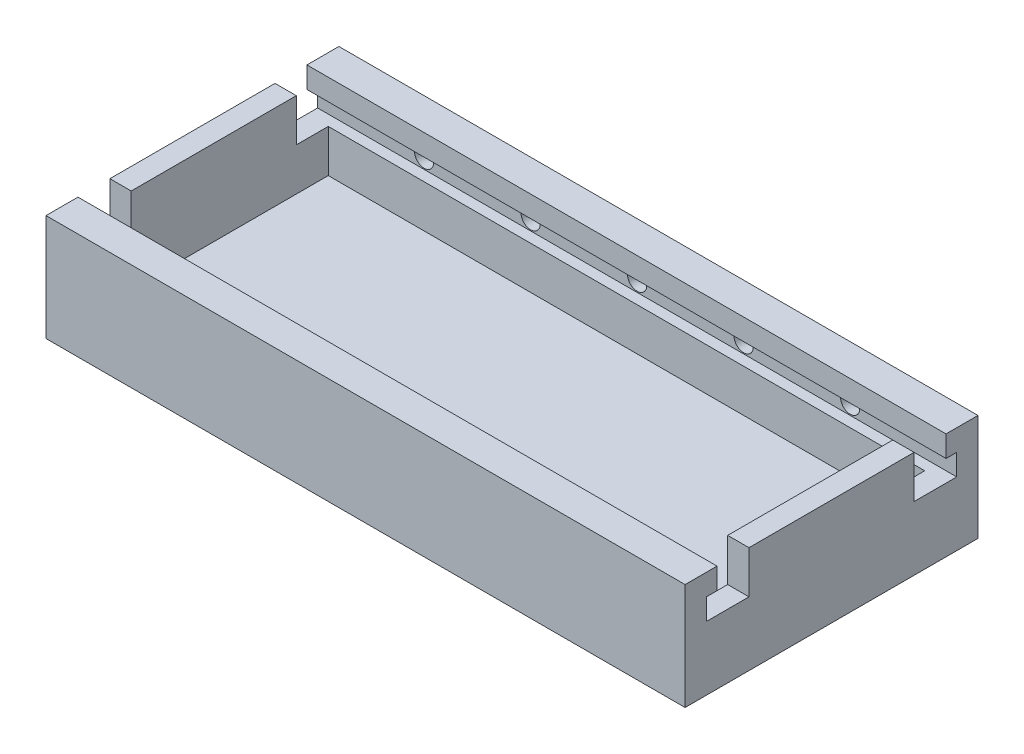
ISO-10303-21;
HEADER;
FILE_DESCRIPTION(('STEP AP214'),'2;1');
FILE_NAME('part.step','',(''),(''),'','','');
FILE_SCHEMA(('AUTOMOTIVE_DESIGN { 1 0 10303 214 1 1 1 1 }'));
ENDSEC;
DATA;
#1=APPLICATION_CONTEXT('core data for automotive mechanical design processes');
#2=APPLICATION_PROTOCOL_DEFINITION('international standard','automotive_design',2000,#1);
#3=PRODUCT_CONTEXT('',#1,'mechanical');
#4=PRODUCT('Part','Part','',(#3));
#5=PRODUCT_RELATED_PRODUCT_CATEGORY('part','',(#4));
#6=PRODUCT_DEFINITION_FORMATION('','',#4);
#7=PRODUCT_DEFINITION_CONTEXT('part definition',#1,'design');
#8=PRODUCT_DEFINITION('design','',#6,#7);
#9=PRODUCT_DEFINITION_SHAPE('','',#8);
#10=(LENGTH_UNIT() NAMED_UNIT(*) SI_UNIT(.MILLI.,.METRE.));
#11=(NAMED_UNIT(*) PLANE_ANGLE_UNIT() SI_UNIT($,.RADIAN.));
#12=(NAMED_UNIT(*) SI_UNIT($,.STERADIAN.) SOLID_ANGLE_UNIT());
#13=UNCERTAINTY_MEASURE_WITH_UNIT(LENGTH_MEASURE(1.E-05),#10,'distance_accuracy_value','');
#14=(GEOMETRIC_REPRESENTATION_CONTEXT(3) GLOBAL_UNCERTAINTY_ASSIGNED_CONTEXT((#13)) GLOBAL_UNIT_ASSIGNED_CONTEXT((#10,
#11,#12)) REPRESENTATION_CONTEXT('',''));
#15=CARTESIAN_POINT('',(0.,0.,0.));
#16=DIRECTION('',(0.,0.,1.));
#17=DIRECTION('',(1.,0.,0.));
#18=AXIS2_PLACEMENT_3D('',#15,#16,#17);
#19=CARTESIAN_POINT('',(48.4572815533981,7.62,-7.60150485436893));
#20=DIRECTION('',(0.,1.,0.));
#21=DIRECTION('',(0.,0.,1.));
#22=AXIS2_PLACEMENT_3D('',#19,#20,#21);
#23=PLANE('',#22);
#24=DIRECTION('',(0.,0.,1.));
#25=VECTOR('',#24,1.);
#26=CARTESIAN_POINT('',(48.4572815533981,7.62,-7.60150485436893));
#27=LINE('',#26,#25);
#28=CARTESIAN_POINT('',(48.4572815533981,7.62,17.1634951456311));
#29=VERTEX_POINT('',#28);
#30=CARTESIAN_POINT('',(48.4572815533981,7.62,22.2434951456311));
#31=VERTEX_POINT('',#30);
#32=EDGE_CURVE('E354',#29,#31,#27,.T.);
#33=ORIENTED_EDGE('',*,*,#32,.F.);
#34=DIRECTION('',(1.,0.,0.));
#35=VECTOR('',#34,1.);
#36=CARTESIAN_POINT('',(45.9172815533981,7.62,17.1634951456311));
#37=LINE('',#36,#35);
#38=CARTESIAN_POINT('',(45.9172815533981,7.62,17.1634951456311));
#39=VERTEX_POINT('',#38);
#40=EDGE_CURVE('E540',#39,#29,#37,.T.);
#41=ORIENTED_EDGE('',*,*,#40,.F.);
#42=DIRECTION('',(0.,0.,-1.));
#43=VECTOR('',#42,1.);
#44=CARTESIAN_POINT('',(45.9172815533981,7.62,-10.1415048543689));
#45=LINE('',#44,#43);
#46=CARTESIAN_POINT('',(45.9172815533981,7.62,20.9734951456311));
#47=VERTEX_POINT('',#46);
#48=EDGE_CURVE('E226',#47,#39,#45,.T.);
#49=ORIENTED_EDGE('',*,*,#48,.F.);
#50=DIRECTION('',(1.,0.,0.));
#51=VECTOR('',#50,1.);
#52=CARTESIAN_POINT('',(-27.7427184466019,7.62,20.9734951456311));
#53=LINE('',#52,#51);
#54=CARTESIAN_POINT('',(-25.2027184466019,7.62,20.9734951456311));
#55=VERTEX_POINT('',#54);
#56=EDGE_CURVE('E362',#55,#47,#53,.T.);
#57=ORIENTED_EDGE('',*,*,#56,.F.);
#58=DIRECTION('',(0.,0.,1.));
#59=VECTOR('',#58,1.);
#60=CARTESIAN_POINT('',(-25.202718446602,7.62,-10.1415048543689));
#61=LINE('',#60,#59);
#62=CARTESIAN_POINT('',(-25.2027184466019,7.62,17.1634951456311));
#63=VERTEX_POINT('',#62);
#64=EDGE_CURVE('E365',#63,#55,#61,.T.);
#65=ORIENTED_EDGE('',*,*,#64,.F.);
#66=DIRECTION('',(1.,0.,0.));
#67=VECTOR('',#66,1.);
#68=CARTESIAN_POINT('',(-27.7427184466019,7.62,17.1634951456311));
#69=LINE('',#68,#67);
#70=CARTESIAN_POINT('',(-27.7427184466019,7.62,17.1634951456311));
#71=VERTEX_POINT('',#70);
#72=EDGE_CURVE('E227',#71,#63,#69,.T.);
#73=ORIENTED_EDGE('',*,*,#72,.F.);
#74=DIRECTION('',(0.,0.,1.));
#75=VECTOR('',#74,1.);
#76=CARTESIAN_POINT('',(-27.7427184466019,7.62,-7.60150485436893));
#77=LINE('',#76,#75);
#78=CARTESIAN_POINT('',(-27.7427184466019,7.62,22.2434951456311));
#79=VERTEX_POINT('',#78);
#80=EDGE_CURVE('E350',#71,#79,#77,.T.);
#81=ORIENTED_EDGE('',*,*,#80,.T.);
#82=DIRECTION('',(-1.,0.,0.));
#83=VECTOR('',#82,1.);
#84=CARTESIAN_POINT('',(48.4572815533981,7.62,22.2434951456311));
#85=LINE('',#84,#83);
#86=EDGE_CURVE('E323',#31,#79,#85,.T.);
#87=ORIENTED_EDGE('',*,*,#86,.F.);
#88=EDGE_LOOP('',(#33,#41,#49,#57,#65,#73,#81,#87));
#89=FACE_BOUND('',#88,.T.);
#90=ADVANCED_FACE('F41',(#89),#23,.T.);
#91=CARTESIAN_POINT('',(45.9172815533981,7.62,-2.52150485436887));
#92=VERTEX_POINT('',#91);
#93=CARTESIAN_POINT('',(45.9172815533981,7.62,-6.33150485436893));
#94=VERTEX_POINT('',#93);
#95=EDGE_CURVE('E360',#92,#94,#45,.T.);
#96=ORIENTED_EDGE('',*,*,#95,.F.);
#97=DIRECTION('',(-1.,0.,0.));
#98=VECTOR('',#97,1.);
#99=CARTESIAN_POINT('',(45.9172815533981,7.62,-2.52150485436887));
#100=LINE('',#99,#98);
#101=CARTESIAN_POINT('',(48.4572815533981,7.62,-2.52150485436887));
#102=VERTEX_POINT('',#101);
#103=EDGE_CURVE('E221',#102,#92,#100,.T.);
#104=ORIENTED_EDGE('',*,*,#103,.F.);
#105=CARTESIAN_POINT('',(48.4572815533981,7.62,-7.60150485436893));
#106=VERTEX_POINT('',#105);
#107=EDGE_CURVE('E355',#106,#102,#27,.T.);
#108=ORIENTED_EDGE('',*,*,#107,.F.);
#109=DIRECTION('',(-1.,0.,0.));
#110=VECTOR('',#109,1.);
#111=CARTESIAN_POINT('',(48.4572815533981,7.62,-7.60150485436893));
#112=LINE('',#111,#110);
#113=CARTESIAN_POINT('',(-27.7427184466019,7.62,-7.60150485436893));
#114=VERTEX_POINT('',#113);
#115=EDGE_CURVE('E335',#106,#114,#112,.T.);
#116=ORIENTED_EDGE('',*,*,#115,.T.);
#117=CARTESIAN_POINT('',(-27.7427184466019,7.62,-2.52150485436887));
#118=VERTEX_POINT('',#117);
#119=EDGE_CURVE('E351',#114,#118,#77,.T.);
#120=ORIENTED_EDGE('',*,*,#119,.T.);
#121=DIRECTION('',(-1.,0.,0.));
#122=VECTOR('',#121,1.);
#123=CARTESIAN_POINT('',(-27.7427184466019,7.62,-2.52150485436887));
#124=LINE('',#123,#122);
#125=CARTESIAN_POINT('',(-25.2027184466019,7.62,-2.52150485436887));
#126=VERTEX_POINT('',#125);
#127=EDGE_CURVE('E229',#126,#118,#124,.T.);
#128=ORIENTED_EDGE('',*,*,#127,.F.);
#129=CARTESIAN_POINT('',(-25.202718446602,7.62,-6.33150485436893));
#130=VERTEX_POINT('',#129);
#131=EDGE_CURVE('E366',#130,#126,#61,.T.);
#132=ORIENTED_EDGE('',*,*,#131,.F.);
#133=DIRECTION('',(-1.,0.,0.));
#134=VECTOR('',#133,1.);
#135=CARTESIAN_POINT('',(-27.742718446602,7.62,-6.33150485436893));
#136=LINE('',#135,#134);
#137=EDGE_CURVE('E12',#94,#130,#136,.T.);
#138=ORIENTED_EDGE('',*,*,#137,.F.);
#139=EDGE_LOOP('',(#96,#104,#108,#116,#120,#128,#132,#138));
#140=FACE_BOUND('',#139,.T.);
#141=ADVANCED_FACE('F451',(#140),#23,.T.);
#142=CARTESIAN_POINT('',(0.,12.7,0.));
#143=DIRECTION('',(0.,1.,0.));
#144=DIRECTION('',(0.,0.,1.));
#145=AXIS2_PLACEMENT_3D('',#142,#143,#144);
#146=PLANE('',#145);
#147=DIRECTION('',(-1.,0.,0.));
#148=VECTOR('',#147,1.);
#149=CARTESIAN_POINT('',(-27.742718446602,12.7,-6.33150485436893));
#150=LINE('',#149,#148);
#151=CARTESIAN_POINT('',(48.4572815533981,12.7,-6.33150485436893));
#152=VERTEX_POINT('',#151);
#153=CARTESIAN_POINT('',(-27.742718446602,12.7,-6.33150485436893));
#154=VERTEX_POINT('',#153);
#155=EDGE_CURVE('E380',#152,#154,#150,.T.);
#156=ORIENTED_EDGE('',*,*,#155,.F.);
#157=DIRECTION('',(0.,0.,-1.));
#158=VECTOR('',#157,1.);
#159=CARTESIAN_POINT('',(48.4572815533981,12.7,-10.1415048543689));
#160=LINE('',#159,#158);
#161=CARTESIAN_POINT('',(48.4572815533981,12.7,-10.1415048543689));
#162=VERTEX_POINT('',#161);
#163=EDGE_CURVE('E400',#152,#162,#160,.T.);
#164=ORIENTED_EDGE('',*,*,#163,.T.);
#165=DIRECTION('',(-1.,0.,0.));
#166=VECTOR('',#165,1.);
#167=CARTESIAN_POINT('',(-27.742718446602,12.7,-10.1415048543689));
#168=LINE('',#167,#166);
#169=CARTESIAN_POINT('',(-27.742718446602,12.7,-10.1415048543689));
#170=VERTEX_POINT('',#169);
#171=EDGE_CURVE('E404',#162,#170,#168,.T.);
#172=ORIENTED_EDGE('',*,*,#171,.T.);
#173=DIRECTION('',(0.,0.,1.));
#174=VECTOR('',#173,1.);
#175=CARTESIAN_POINT('',(-27.742718446602,12.7,-10.1415048543689));
#176=LINE('',#175,#174);
#177=EDGE_CURVE('E394',#170,#154,#176,.T.);
#178=ORIENTED_EDGE('',*,*,#177,.T.);
#179=EDGE_LOOP('',(#156,#164,#172,#178));
#180=FACE_BOUND('',#179,.T.);
#181=ADVANCED_FACE('F458',(#180),#146,.T.);
#182=CARTESIAN_POINT('',(48.4572815533981,10.16,-7.60150485436893));
#183=DIRECTION('',(0.,-1.,0.));
#184=DIRECTION('',(0.,0.,-1.));
#185=AXIS2_PLACEMENT_3D('',#182,#183,#184);
#186=PLANE('',#185);
#187=DIRECTION('',(0.,0.,1.));
#188=VECTOR('',#187,1.);
#189=CARTESIAN_POINT('',(48.4572815533981,10.16,-7.60150485436893));
#190=LINE('',#189,#188);
#191=CARTESIAN_POINT('',(48.4572815533981,10.16,-7.60150485436893));
#192=VERTEX_POINT('',#191);
#193=CARTESIAN_POINT('',(48.4572815533981,10.16,-6.33150485436893));
#194=VERTEX_POINT('',#193);
#195=EDGE_CURVE('E343',#192,#194,#190,.T.);
#196=ORIENTED_EDGE('',*,*,#195,.T.);
#197=DIRECTION('',(1.,0.,0.));
#198=VECTOR('',#197,1.);
#199=CARTESIAN_POINT('',(-27.742718446602,10.16,-6.33150485436893));
#200=LINE('',#199,#198);
#201=CARTESIAN_POINT('',(-27.7427184466019,10.16,-6.33150485436893));
#202=VERTEX_POINT('',#201);
#203=EDGE_CURVE('E50',#202,#194,#200,.T.);
#204=ORIENTED_EDGE('',*,*,#203,.F.);
#205=DIRECTION('',(0.,0.,1.));
#206=VECTOR('',#205,1.);
#207=CARTESIAN_POINT('',(-27.7427184466019,10.16,-7.60150485436893));
#208=LINE('',#207,#206);
#209=CARTESIAN_POINT('',(-27.7427184466019,10.16,-7.60150485436893));
#210=VERTEX_POINT('',#209);
#211=EDGE_CURVE('E347',#210,#202,#208,.T.);
#212=ORIENTED_EDGE('',*,*,#211,.F.);
#213=DIRECTION('',(1.,0.,0.));
#214=VECTOR('',#213,1.);
#215=CARTESIAN_POINT('',(48.4572815533981,10.16,-7.60150485436893));
#216=LINE('',#215,#214);
#217=EDGE_CURVE('E340',#210,#192,#216,.T.);
#218=ORIENTED_EDGE('',*,*,#217,.T.);
#219=EDGE_LOOP('',(#196,#204,#212,#218));
#220=FACE_BOUND('',#219,.T.);
#221=ADVANCED_FACE('F528',(#220),#186,.T.);
#222=CARTESIAN_POINT('',(-27.7427184466019,12.7,20.9734951456311));
#223=DIRECTION('',(0.,0.,-1.));
#224=DIRECTION('',(-1.,0.,0.));
#225=AXIS2_PLACEMENT_3D('',#222,#223,#224);
#226=PLANE('',#225);
#227=DIRECTION('',(1.,0.,0.));
#228=VECTOR('',#227,1.);
#229=CARTESIAN_POINT('',(-27.7427184466019,12.7,20.9734951456311));
#230=LINE('',#229,#228);
#231=CARTESIAN_POINT('',(-27.742718446602,12.7,20.9734951456311));
#232=VERTEX_POINT('',#231);
#233=CARTESIAN_POINT('',(48.4572815533981,12.7,20.9734951456311));
#234=VERTEX_POINT('',#233);
#235=EDGE_CURVE('E391',#232,#234,#230,.T.);
#236=ORIENTED_EDGE('',*,*,#235,.T.);
#237=DIRECTION('',(0.,1.,0.));
#238=VECTOR('',#237,1.);
#239=CARTESIAN_POINT('',(48.4572815533981,10.16,20.9734951456311));
#240=LINE('',#239,#238);
#241=CARTESIAN_POINT('',(48.4572815533981,10.16,20.9734951456311));
#242=VERTEX_POINT('',#241);
#243=EDGE_CURVE('E308',#242,#234,#240,.T.);
#244=ORIENTED_EDGE('',*,*,#243,.F.);
#245=DIRECTION('',(-1.,0.,0.));
#246=VECTOR('',#245,1.);
#247=CARTESIAN_POINT('',(-27.7427184466019,10.16,20.9734951456311));
#248=LINE('',#247,#246);
#249=CARTESIAN_POINT('',(-27.742718446602,10.16,20.9734951456311));
#250=VERTEX_POINT('',#249);
#251=EDGE_CURVE('E358',#242,#250,#248,.T.);
#252=ORIENTED_EDGE('',*,*,#251,.T.);
#253=DIRECTION('',(0.,1.,0.));
#254=VECTOR('',#253,1.);
#255=CARTESIAN_POINT('',(-27.742718446602,10.16,20.9734951456311));
#256=LINE('',#255,#254);
#257=EDGE_CURVE('E315',#250,#232,#256,.T.);
#258=ORIENTED_EDGE('',*,*,#257,.T.);
#259=EDGE_LOOP('',(#236,#244,#252,#258));
#260=FACE_BOUND('',#259,.T.);
#261=ADVANCED_FACE('F473',(#260),#226,.T.);
#262=CARTESIAN_POINT('',(-27.742718446602,12.7,-6.33150485436893));
#263=DIRECTION('',(0.,0.,1.));
#264=DIRECTION('',(1.,0.,0.));
#265=AXIS2_PLACEMENT_3D('',#262,#263,#264);
#266=PLANE('',#265);
#267=ORIENTED_EDGE('',*,*,#155,.T.);
#268=DIRECTION('',(0.,1.,0.));
#269=VECTOR('',#268,1.);
#270=CARTESIAN_POINT('',(-27.742718446602,10.16,-6.33150485436893));
#271=LINE('',#270,#269);
#272=EDGE_CURVE('E312',#202,#154,#271,.T.);
#273=ORIENTED_EDGE('',*,*,#272,.F.);
#274=ORIENTED_EDGE('',*,*,#203,.T.);
#275=DIRECTION('',(0.,1.,0.));
#276=VECTOR('',#275,1.);
#277=CARTESIAN_POINT('',(48.4572815533981,10.16,-6.33150485436893));
#278=LINE('',#277,#276);
#279=EDGE_CURVE('E309',#194,#152,#278,.T.);
#280=ORIENTED_EDGE('',*,*,#279,.T.);
#281=EDGE_LOOP('',(#267,#273,#274,#280));
#282=FACE_BOUND('',#281,.T.);
#283=ADVANCED_FACE('F481',(#282),#266,.T.);
#284=CARTESIAN_POINT('',(-27.742718446602,12.7,-10.1415048543689));
#285=DIRECTION('',(1.,0.,0.));
#286=DIRECTION('',(0.,0.,-1.));
#287=AXIS2_PLACEMENT_3D('',#284,#285,#286);
#288=PLANE('',#287);
#289=CARTESIAN_POINT('',(-27.7427184466019,12.7,24.7834951456311));
#290=VERTEX_POINT('',#289);
#291=EDGE_CURVE('E398',#232,#290,#176,.T.);
#292=ORIENTED_EDGE('',*,*,#291,.F.);
#293=ORIENTED_EDGE('',*,*,#257,.F.);
#294=CARTESIAN_POINT('',(-27.7427184466019,10.16,22.2434951456311));
#295=VERTEX_POINT('',#294);
#296=EDGE_CURVE('E346',#250,#295,#208,.T.);
#297=ORIENTED_EDGE('',*,*,#296,.T.);
#298=DIRECTION('',(0.,1.,0.));
#299=VECTOR('',#298,1.);
#300=CARTESIAN_POINT('',(-27.7427184466019,10.16,22.2434951456311));
#301=LINE('',#300,#299);
#302=EDGE_CURVE('E326',#79,#295,#301,.T.);
#303=ORIENTED_EDGE('',*,*,#302,.F.);
#304=ORIENTED_EDGE('',*,*,#80,.F.);
#305=DIRECTION('',(0.,-1.,0.));
#306=VECTOR('',#305,1.);
#307=CARTESIAN_POINT('',(-27.7427184466019,12.7,17.1634951456311));
#308=LINE('',#307,#306);
#309=CARTESIAN_POINT('',(-27.7427184466019,12.7,17.1634951456311));
#310=VERTEX_POINT('',#309);
#311=EDGE_CURVE('E251',#310,#71,#308,.T.);
#312=ORIENTED_EDGE('',*,*,#311,.F.);
#313=DIRECTION('',(0.,0.,1.));
#314=VECTOR('',#313,1.);
#315=CARTESIAN_POINT('',(-27.7427184466019,12.7,-2.52150485436887));
#316=LINE('',#315,#314);
#317=CARTESIAN_POINT('',(-27.7427184466019,12.7,-2.52150485436887));
#318=VERTEX_POINT('',#317);
#319=EDGE_CURVE('E235',#318,#310,#316,.T.);
#320=ORIENTED_EDGE('',*,*,#319,.F.);
#321=DIRECTION('',(0.,-1.,0.));
#322=VECTOR('',#321,1.);
#323=CARTESIAN_POINT('',(-27.7427184466019,12.7,-2.52150485436887));
#324=LINE('',#323,#322);
#325=EDGE_CURVE('E243',#318,#118,#324,.T.);
#326=ORIENTED_EDGE('',*,*,#325,.T.);
#327=ORIENTED_EDGE('',*,*,#119,.F.);
#328=DIRECTION('',(0.,1.,0.));
#329=VECTOR('',#328,1.);
#330=CARTESIAN_POINT('',(-27.7427184466019,10.16,-7.60150485436893));
#331=LINE('',#330,#329);
#332=EDGE_CURVE('E337',#114,#210,#331,.T.);
#333=ORIENTED_EDGE('',*,*,#332,.T.);
#334=ORIENTED_EDGE('',*,*,#211,.T.);
#335=ORIENTED_EDGE('',*,*,#272,.T.);
#336=ORIENTED_EDGE('',*,*,#177,.F.);
#337=DIRECTION('',(0.,-1.,0.));
#338=VECTOR('',#337,1.);
#339=CARTESIAN_POINT('',(-27.742718446602,12.7,-10.1415048543689));
#340=LINE('',#339,#338);
#341=CARTESIAN_POINT('',(-27.742718446602,0.,-10.1415048543689));
#342=VERTEX_POINT('',#341);
#343=EDGE_CURVE('E406',#170,#342,#340,.T.);
#344=ORIENTED_EDGE('',*,*,#343,.T.);
#345=DIRECTION('',(0.,0.,1.));
#346=VECTOR('',#345,1.);
#347=CARTESIAN_POINT('',(-27.742718446602,0.,-10.1415048543689));
#348=LINE('',#347,#346);
#349=CARTESIAN_POINT('',(-27.7427184466019,0.,24.7834951456311));
#350=VERTEX_POINT('',#349);
#351=EDGE_CURVE('E375',#342,#350,#348,.T.);
#352=ORIENTED_EDGE('',*,*,#351,.T.);
#353=DIRECTION('',(0.,-1.,0.));
#354=VECTOR('',#353,1.);
#355=CARTESIAN_POINT('',(-27.7427184466019,12.7,24.7834951456311));
#356=LINE('',#355,#354);
#357=EDGE_CURVE('E423',#290,#350,#356,.T.);
#358=ORIENTED_EDGE('',*,*,#357,.F.);
#359=EDGE_LOOP('',(#292,#293,#297,#303,#304,#312,#320,#326,#327,#333,#334,#335,#336,#344,#352,#358));
#360=FACE_BOUND('',#359,.T.);
#361=ADVANCED_FACE('F43',(#360),#288,.F.);
#362=CARTESIAN_POINT('',(-27.7427184466019,12.7,24.7834951456311));
#363=DIRECTION('',(0.,0.,-1.));
#364=DIRECTION('',(-1.,0.,0.));
#365=AXIS2_PLACEMENT_3D('',#362,#363,#364);
#366=PLANE('',#365);
#367=DIRECTION('',(1.,0.,0.));
#368=VECTOR('',#367,1.);
#369=CARTESIAN_POINT('',(-27.7427184466019,0.,24.7834951456311));
#370=LINE('',#369,#368);
#371=CARTESIAN_POINT('',(48.4572815533981,0.,24.7834951456311));
#372=VERTEX_POINT('',#371);
#373=EDGE_CURVE('E409',#350,#372,#370,.T.);
#374=ORIENTED_EDGE('',*,*,#373,.T.);
#375=DIRECTION('',(0.,-1.,0.));
#376=VECTOR('',#375,1.);
#377=CARTESIAN_POINT('',(48.4572815533981,12.7,24.7834951456311));
#378=LINE('',#377,#376);
#379=CARTESIAN_POINT('',(48.4572815533981,12.7,24.7834951456311));
#380=VERTEX_POINT('',#379);
#381=EDGE_CURVE('E420',#380,#372,#378,.T.);
#382=ORIENTED_EDGE('',*,*,#381,.F.);
#383=DIRECTION('',(1.,0.,0.));
#384=VECTOR('',#383,1.);
#385=CARTESIAN_POINT('',(-27.7427184466019,12.7,24.7834951456311));
#386=LINE('',#385,#384);
#387=EDGE_CURVE('E397',#290,#380,#386,.T.);
#388=ORIENTED_EDGE('',*,*,#387,.F.);
#389=ORIENTED_EDGE('',*,*,#357,.T.);
#390=EDGE_LOOP('',(#374,#382,#388,#389));
#391=FACE_BOUND('',#390,.T.);
#392=ADVANCED_FACE('F500',(#391),#366,.F.);
#393=CARTESIAN_POINT('',(48.4572815533981,12.7,-10.1415048543689));
#394=DIRECTION('',(-1.,0.,0.));
#395=DIRECTION('',(0.,0.,1.));
#396=AXIS2_PLACEMENT_3D('',#393,#394,#395);
#397=PLANE('',#396);
#398=ORIENTED_EDGE('',*,*,#163,.F.);
#399=ORIENTED_EDGE('',*,*,#279,.F.);
#400=ORIENTED_EDGE('',*,*,#195,.F.);
#401=DIRECTION('',(0.,-1.,0.));
#402=VECTOR('',#401,1.);
#403=CARTESIAN_POINT('',(48.4572815533981,10.16,-7.60150485436893));
#404=LINE('',#403,#402);
#405=EDGE_CURVE('E332',#192,#106,#404,.T.);
#406=ORIENTED_EDGE('',*,*,#405,.T.);
#407=ORIENTED_EDGE('',*,*,#107,.T.);
#408=DIRECTION('',(0.,-1.,0.));
#409=VECTOR('',#408,1.);
#410=CARTESIAN_POINT('',(48.4572815533981,12.7,-2.52150485436887));
#411=LINE('',#410,#409);
#412=CARTESIAN_POINT('',(48.4572815533981,12.7,-2.52150485436887));
#413=VERTEX_POINT('',#412);
#414=EDGE_CURVE('E231',#413,#102,#411,.T.);
#415=ORIENTED_EDGE('',*,*,#414,.F.);
#416=DIRECTION('',(0.,0.,-1.));
#417=VECTOR('',#416,1.);
#418=CARTESIAN_POINT('',(48.4572815533981,12.7,-2.52150485436887));
#419=LINE('',#418,#417);
#420=CARTESIAN_POINT('',(48.4572815533981,12.7,17.1634951456311));
#421=VERTEX_POINT('',#420);
#422=EDGE_CURVE('E215',#421,#413,#419,.T.);
#423=ORIENTED_EDGE('',*,*,#422,.F.);
#424=DIRECTION('',(0.,-1.,0.));
#425=VECTOR('',#424,1.);
#426=CARTESIAN_POINT('',(48.4572815533981,12.7,17.1634951456311));
#427=LINE('',#426,#425);
#428=EDGE_CURVE('E212',#421,#29,#427,.T.);
#429=ORIENTED_EDGE('',*,*,#428,.T.);
#430=ORIENTED_EDGE('',*,*,#32,.T.);
#431=DIRECTION('',(0.,-1.,0.));
#432=VECTOR('',#431,1.);
#433=CARTESIAN_POINT('',(48.4572815533981,10.16,22.2434951456311));
#434=LINE('',#433,#432);
#435=CARTESIAN_POINT('',(48.4572815533981,10.16,22.2434951456311));
#436=VERTEX_POINT('',#435);
#437=EDGE_CURVE('E318',#436,#31,#434,.T.);
#438=ORIENTED_EDGE('',*,*,#437,.F.);
#439=EDGE_CURVE('E342',#242,#436,#190,.T.);
#440=ORIENTED_EDGE('',*,*,#439,.F.);
#441=ORIENTED_EDGE('',*,*,#243,.T.);
#442=EDGE_CURVE('E401',#380,#234,#160,.T.);
#443=ORIENTED_EDGE('',*,*,#442,.F.);
#444=ORIENTED_EDGE('',*,*,#381,.T.);
#445=DIRECTION('',(0.,0.,-1.));
#446=VECTOR('',#445,1.);
#447=CARTESIAN_POINT('',(48.4572815533981,0.,-10.1415048543689));
#448=LINE('',#447,#446);
#449=CARTESIAN_POINT('',(48.4572815533981,0.,-10.1415048543689));
#450=VERTEX_POINT('',#449);
#451=EDGE_CURVE('E411',#372,#450,#448,.T.);
#452=ORIENTED_EDGE('',*,*,#451,.T.);
#453=DIRECTION('',(0.,-1.,0.));
#454=VECTOR('',#453,1.);
#455=CARTESIAN_POINT('',(48.4572815533981,12.7,-10.1415048543689));
#456=LINE('',#455,#454);
#457=EDGE_CURVE('E417',#162,#450,#456,.T.);
#458=ORIENTED_EDGE('',*,*,#457,.F.);
#459=EDGE_LOOP('',(#398,#399,#400,#406,#407,#415,#423,#429,#430,#438,#440,#441,#443,#444,#452,#458));
#460=FACE_BOUND('',#459,.T.);
#461=ADVANCED_FACE('F497',(#460),#397,.F.);
#462=CARTESIAN_POINT('',(-27.742718446602,12.7,-10.1415048543689));
#463=DIRECTION('',(0.,0.,1.));
#464=DIRECTION('',(1.,0.,0.));
#465=AXIS2_PLACEMENT_3D('',#462,#463,#464);
#466=PLANE('',#465);
#467=DIRECTION('',(-1.,0.,0.));
#468=VECTOR('',#467,1.);
#469=CARTESIAN_POINT('',(-27.742718446602,0.,-10.1415048543689));
#470=LINE('',#469,#468);
#471=EDGE_CURVE('E413',#450,#342,#470,.T.);
#472=ORIENTED_EDGE('',*,*,#471,.T.);
#473=ORIENTED_EDGE('',*,*,#343,.F.);
#474=ORIENTED_EDGE('',*,*,#171,.F.);
#475=ORIENTED_EDGE('',*,*,#457,.T.);
#476=EDGE_LOOP('',(#472,#473,#474,#475));
#477=FACE_BOUND('',#476,.T.);
#478=ADVANCED_FACE('F490',(#477),#466,.F.);
#479=ORIENTED_EDGE('',*,*,#442,.T.);
#480=ORIENTED_EDGE('',*,*,#235,.F.);
#481=ORIENTED_EDGE('',*,*,#291,.T.);
#482=ORIENTED_EDGE('',*,*,#387,.T.);
#483=EDGE_LOOP('',(#479,#480,#481,#482));
#484=FACE_BOUND('',#483,.T.);
#485=ADVANCED_FACE('F486',(#484),#146,.T.);
#486=CARTESIAN_POINT('',(0.,0.,0.));
#487=DIRECTION('',(0.,1.,0.));
#488=DIRECTION('',(0.,0.,1.));
#489=AXIS2_PLACEMENT_3D('',#486,#487,#488);
#490=PLANE('',#489);
#491=ORIENTED_EDGE('',*,*,#351,.F.);
#492=ORIENTED_EDGE('',*,*,#471,.F.);
#493=ORIENTED_EDGE('',*,*,#451,.F.);
#494=ORIENTED_EDGE('',*,*,#373,.F.);
#495=EDGE_LOOP('',(#491,#492,#493,#494));
#496=FACE_BOUND('',#495,.T.);
#497=ADVANCED_FACE('F489',(#496),#490,.F.);
#498=ORIENTED_EDGE('',*,*,#251,.F.);
#499=ORIENTED_EDGE('',*,*,#439,.T.);
#500=DIRECTION('',(1.,0.,0.));
#501=VECTOR('',#500,1.);
#502=CARTESIAN_POINT('',(48.4572815533981,10.16,22.2434951456311));
#503=LINE('',#502,#501);
#504=EDGE_CURVE('E329',#295,#436,#503,.T.);
#505=ORIENTED_EDGE('',*,*,#504,.F.);
#506=ORIENTED_EDGE('',*,*,#296,.F.);
#507=EDGE_LOOP('',(#498,#499,#505,#506));
#508=FACE_BOUND('',#507,.T.);
#509=ADVANCED_FACE('F463',(#508),#186,.T.);
#510=CARTESIAN_POINT('',(0.,0.,-7.60150485436893));
#511=DIRECTION('',(0.,0.,-1.));
#512=DIRECTION('',(-1.,0.,0.));
#513=AXIS2_PLACEMENT_3D('',#510,#511,#512);
#514=PLANE('',#513);
#515=CARTESIAN_POINT('',(-15.0427184466019,8.88999999999995,-7.60150485436893));
#516=DIRECTION('',(0.,0.,1.));
#517=DIRECTION('',(1.,0.,0.));
#518=AXIS2_PLACEMENT_3D('',#515,#516,#517);
#519=CIRCLE('',#518,1.143);
#520=CARTESIAN_POINT('',(-13.8997184466019,8.88999999999995,-7.60150485436893));
#521=VERTEX_POINT('',#520);
#522=EDGE_CURVE('E293',#521,#521,#519,.T.);
#523=ORIENTED_EDGE('',*,*,#522,.F.);
#524=EDGE_LOOP('',(#523));
#525=FACE_BOUND('',#524,.T.);
#526=CARTESIAN_POINT('',(-2.34271844660195,8.88999999999997,-7.60150485436893));
#527=DIRECTION('',(0.,0.,1.));
#528=DIRECTION('',(1.,0.,0.));
#529=AXIS2_PLACEMENT_3D('',#526,#527,#528);
#530=CIRCLE('',#529,1.143);
#531=CARTESIAN_POINT('',(-1.19971844660195,8.88999999999997,-7.60150485436893));
#532=VERTEX_POINT('',#531);
#533=EDGE_CURVE('E296',#532,#532,#530,.T.);
#534=ORIENTED_EDGE('',*,*,#533,.F.);
#535=EDGE_LOOP('',(#534));
#536=FACE_BOUND('',#535,.T.);
#537=CARTESIAN_POINT('',(35.7572815533981,8.89000000000005,-7.60150485436893));
#538=DIRECTION('',(0.,0.,1.));
#539=DIRECTION('',(1.,0.,0.));
#540=AXIS2_PLACEMENT_3D('',#537,#538,#539);
#541=CIRCLE('',#540,1.143);
#542=CARTESIAN_POINT('',(36.9002815533981,8.89000000000005,-7.60150485436893));
#543=VERTEX_POINT('',#542);
#544=EDGE_CURVE('E299',#543,#543,#541,.T.);
#545=ORIENTED_EDGE('',*,*,#544,.F.);
#546=EDGE_LOOP('',(#545));
#547=FACE_BOUND('',#546,.T.);
#548=CARTESIAN_POINT('',(23.0572815533981,8.89000000000002,-7.60150485436893));
#549=DIRECTION('',(0.,0.,1.));
#550=DIRECTION('',(1.,0.,0.));
#551=AXIS2_PLACEMENT_3D('',#548,#549,#550);
#552=CIRCLE('',#551,1.143);
#553=CARTESIAN_POINT('',(24.2002815533981,8.89000000000002,-7.60150485436893));
#554=VERTEX_POINT('',#553);
#555=EDGE_CURVE('E302',#554,#554,#552,.T.);
#556=ORIENTED_EDGE('',*,*,#555,.F.);
#557=EDGE_LOOP('',(#556));
#558=FACE_BOUND('',#557,.T.);
#559=CARTESIAN_POINT('',(10.3572815533981,8.89,-7.60150485436893));
#560=DIRECTION('',(0.,0.,1.));
#561=DIRECTION('',(1.,0.,0.));
#562=AXIS2_PLACEMENT_3D('',#559,#560,#561);
#563=CIRCLE('',#562,1.143);
#564=CARTESIAN_POINT('',(11.5002815533981,8.89,-7.60150485436893));
#565=VERTEX_POINT('',#564);
#566=EDGE_CURVE('E305',#565,#565,#563,.T.);
#567=ORIENTED_EDGE('',*,*,#566,.F.);
#568=EDGE_LOOP('',(#567));
#569=FACE_BOUND('',#568,.T.);
#570=ORIENTED_EDGE('',*,*,#405,.F.);
#571=ORIENTED_EDGE('',*,*,#217,.F.);
#572=ORIENTED_EDGE('',*,*,#332,.F.);
#573=ORIENTED_EDGE('',*,*,#115,.F.);
#574=EDGE_LOOP('',(#570,#571,#572,#573));
#575=FACE_BOUND('',#574,.T.);
#576=ADVANCED_FACE('F533',(#525,#536,#547,#558,#569,#575),#514,.F.);
#577=CARTESIAN_POINT('',(0.,0.,22.2434951456311));
#578=DIRECTION('',(0.,0.,-1.));
#579=DIRECTION('',(-1.,0.,0.));
#580=AXIS2_PLACEMENT_3D('',#577,#578,#579);
#581=PLANE('',#580);
#582=CARTESIAN_POINT('',(-15.042718446602,8.89000000000006,22.2434951456311));
#583=DIRECTION('',(0.,0.,-1.));
#584=DIRECTION('',(1.,0.,0.));
#585=AXIS2_PLACEMENT_3D('',#582,#583,#584);
#586=CIRCLE('',#585,1.143);
#587=CARTESIAN_POINT('',(-13.899718446602,8.89000000000006,22.2434951456311));
#588=VERTEX_POINT('',#587);
#589=EDGE_CURVE('E278',#588,#588,#586,.T.);
#590=ORIENTED_EDGE('',*,*,#589,.F.);
#591=EDGE_LOOP('',(#590));
#592=FACE_BOUND('',#591,.T.);
#593=CARTESIAN_POINT('',(-2.34271844660195,8.89000000000003,22.2434951456311));
#594=DIRECTION('',(0.,0.,-1.));
#595=DIRECTION('',(1.,0.,0.));
#596=AXIS2_PLACEMENT_3D('',#593,#594,#595);
#597=CIRCLE('',#596,1.143);
#598=CARTESIAN_POINT('',(-1.19971844660195,8.89000000000003,22.2434951456311));
#599=VERTEX_POINT('',#598);
#600=EDGE_CURVE('E281',#599,#599,#597,.T.);
#601=ORIENTED_EDGE('',*,*,#600,.F.);
#602=EDGE_LOOP('',(#601));
#603=FACE_BOUND('',#602,.T.);
#604=CARTESIAN_POINT('',(35.7572815533981,8.88999999999995,22.2434951456311));
#605=DIRECTION('',(0.,0.,-1.));
#606=DIRECTION('',(1.,0.,0.));
#607=AXIS2_PLACEMENT_3D('',#604,#605,#606);
#608=CIRCLE('',#607,1.143);
#609=CARTESIAN_POINT('',(36.9002815533981,8.88999999999995,22.2434951456311));
#610=VERTEX_POINT('',#609);
#611=EDGE_CURVE('E284',#610,#610,#608,.T.);
#612=ORIENTED_EDGE('',*,*,#611,.F.);
#613=EDGE_LOOP('',(#612));
#614=FACE_BOUND('',#613,.T.);
#615=CARTESIAN_POINT('',(23.0572815533981,8.88999999999997,22.2434951456311));
#616=DIRECTION('',(0.,0.,-1.));
#617=DIRECTION('',(1.,0.,0.));
#618=AXIS2_PLACEMENT_3D('',#615,#616,#617);
#619=CIRCLE('',#618,1.143);
#620=CARTESIAN_POINT('',(24.2002815533981,8.88999999999997,22.2434951456311));
#621=VERTEX_POINT('',#620);
#622=EDGE_CURVE('E287',#621,#621,#619,.T.);
#623=ORIENTED_EDGE('',*,*,#622,.F.);
#624=EDGE_LOOP('',(#623));
#625=FACE_BOUND('',#624,.T.);
#626=CARTESIAN_POINT('',(10.3572815533981,8.89,22.2434951456311));
#627=DIRECTION('',(0.,0.,-1.));
#628=DIRECTION('',(1.,0.,0.));
#629=AXIS2_PLACEMENT_3D('',#626,#627,#628);
#630=CIRCLE('',#629,1.143);
#631=CARTESIAN_POINT('',(11.5002815533981,8.89,22.2434951456311));
#632=VERTEX_POINT('',#631);
#633=EDGE_CURVE('E290',#632,#632,#630,.T.);
#634=ORIENTED_EDGE('',*,*,#633,.F.);
#635=EDGE_LOOP('',(#634));
#636=FACE_BOUND('',#635,.T.);
#637=ORIENTED_EDGE('',*,*,#437,.T.);
#638=ORIENTED_EDGE('',*,*,#86,.T.);
#639=ORIENTED_EDGE('',*,*,#302,.T.);
#640=ORIENTED_EDGE('',*,*,#504,.T.);
#641=EDGE_LOOP('',(#637,#638,#639,#640));
#642=FACE_BOUND('',#641,.T.);
#643=ADVANCED_FACE('F484',(#592,#603,#614,#625,#636,#642),#581,.T.);
#644=CARTESIAN_POINT('',(0.,2.54,0.));
#645=DIRECTION('',(0.,1.,0.));
#646=DIRECTION('',(0.,0.,1.));
#647=AXIS2_PLACEMENT_3D('',#644,#645,#646);
#648=PLANE('',#647);
#649=DIRECTION('',(0.,0.,1.));
#650=VECTOR('',#649,1.);
#651=CARTESIAN_POINT('',(-25.202718446602,2.54,-10.1415048543689));
#652=LINE('',#651,#650);
#653=CARTESIAN_POINT('',(-25.202718446602,2.54,-6.33150485436893));
#654=VERTEX_POINT('',#653);
#655=CARTESIAN_POINT('',(-25.2027184466019,2.54,20.9734951456311));
#656=VERTEX_POINT('',#655);
#657=EDGE_CURVE('E369',#654,#656,#652,.T.);
#658=ORIENTED_EDGE('',*,*,#657,.T.);
#659=DIRECTION('',(1.,0.,0.));
#660=VECTOR('',#659,1.);
#661=CARTESIAN_POINT('',(-27.7427184466019,2.54,20.9734951456311));
#662=LINE('',#661,#660);
#663=CARTESIAN_POINT('',(45.9172815533981,2.54,20.9734951456311));
#664=VERTEX_POINT('',#663);
#665=EDGE_CURVE('E372',#656,#664,#662,.T.);
#666=ORIENTED_EDGE('',*,*,#665,.T.);
#667=DIRECTION('',(0.,0.,-1.));
#668=VECTOR('',#667,1.);
#669=CARTESIAN_POINT('',(45.9172815533981,2.54,-10.1415048543689));
#670=LINE('',#669,#668);
#671=CARTESIAN_POINT('',(45.9172815533981,2.54,-6.33150485436893));
#672=VERTEX_POINT('',#671);
#673=EDGE_CURVE('E383',#664,#672,#670,.T.);
#674=ORIENTED_EDGE('',*,*,#673,.T.);
#675=DIRECTION('',(-1.,0.,0.));
#676=VECTOR('',#675,1.);
#677=CARTESIAN_POINT('',(-27.742718446602,2.54,-6.33150485436893));
#678=LINE('',#677,#676);
#679=EDGE_CURVE('E387',#672,#654,#678,.T.);
#680=ORIENTED_EDGE('',*,*,#679,.T.);
#681=EDGE_LOOP('',(#658,#666,#674,#680));
#682=FACE_BOUND('',#681,.T.);
#683=ADVANCED_FACE('F479',(#682),#648,.T.);
#684=DIRECTION('',(0.,-1.,0.));
#685=VECTOR('',#684,1.);
#686=CARTESIAN_POINT('',(45.9172815533981,12.7,-6.33150485436893));
#687=LINE('',#686,#685);
#688=EDGE_CURVE('E379',#94,#672,#687,.T.);
#689=ORIENTED_EDGE('',*,*,#688,.F.);
#690=ORIENTED_EDGE('',*,*,#137,.T.);
#691=DIRECTION('',(0.,-1.,0.));
#692=VECTOR('',#691,1.);
#693=CARTESIAN_POINT('',(-25.202718446602,12.7,-6.33150485436893));
#694=LINE('',#693,#692);
#695=EDGE_CURVE('E377',#130,#654,#694,.T.);
#696=ORIENTED_EDGE('',*,*,#695,.T.);
#697=ORIENTED_EDGE('',*,*,#679,.F.);
#698=EDGE_LOOP('',(#689,#690,#696,#697));
#699=FACE_BOUND('',#698,.T.);
#700=ADVANCED_FACE('F476',(#699),#266,.T.);
#701=CARTESIAN_POINT('',(45.9172815533981,12.7,-10.1415048543689));
#702=DIRECTION('',(-1.,0.,0.));
#703=DIRECTION('',(0.,0.,1.));
#704=AXIS2_PLACEMENT_3D('',#701,#702,#703);
#705=PLANE('',#704);
#706=DIRECTION('',(0.,-1.,0.));
#707=VECTOR('',#706,1.);
#708=CARTESIAN_POINT('',(45.9172815533981,12.7,20.9734951456311));
#709=LINE('',#708,#707);
#710=EDGE_CURVE('E376',#47,#664,#709,.T.);
#711=ORIENTED_EDGE('',*,*,#710,.F.);
#712=ORIENTED_EDGE('',*,*,#48,.T.);
#713=DIRECTION('',(0.,-1.,0.));
#714=VECTOR('',#713,1.);
#715=CARTESIAN_POINT('',(45.9172815533981,12.7,17.1634951456311));
#716=LINE('',#715,#714);
#717=CARTESIAN_POINT('',(45.9172815533981,12.7,17.1634951456311));
#718=VERTEX_POINT('',#717);
#719=EDGE_CURVE('E209',#718,#39,#716,.T.);
#720=ORIENTED_EDGE('',*,*,#719,.F.);
#721=DIRECTION('',(0.,0.,1.));
#722=VECTOR('',#721,1.);
#723=CARTESIAN_POINT('',(45.9172815533981,12.7,-2.52150485436887));
#724=LINE('',#723,#722);
#725=CARTESIAN_POINT('',(45.9172815533981,12.7,-2.52150485436887));
#726=VERTEX_POINT('',#725);
#727=EDGE_CURVE('E216',#726,#718,#724,.T.);
#728=ORIENTED_EDGE('',*,*,#727,.F.);
#729=DIRECTION('',(0.,-1.,0.));
#730=VECTOR('',#729,1.);
#731=CARTESIAN_POINT('',(45.9172815533981,12.7,-2.52150485436887));
#732=LINE('',#731,#730);
#733=EDGE_CURVE('E58',#726,#92,#732,.T.);
#734=ORIENTED_EDGE('',*,*,#733,.T.);
#735=ORIENTED_EDGE('',*,*,#95,.T.);
#736=ORIENTED_EDGE('',*,*,#688,.T.);
#737=ORIENTED_EDGE('',*,*,#673,.F.);
#738=EDGE_LOOP('',(#711,#712,#720,#728,#734,#735,#736,#737));
#739=FACE_BOUND('',#738,.T.);
#740=ADVANCED_FACE('F225',(#739),#705,.T.);
#741=DIRECTION('',(0.,-1.,0.));
#742=VECTOR('',#741,1.);
#743=CARTESIAN_POINT('',(-25.2027184466019,12.7,20.9734951456311));
#744=LINE('',#743,#742);
#745=EDGE_CURVE('E373',#55,#656,#744,.T.);
#746=ORIENTED_EDGE('',*,*,#745,.F.);
#747=ORIENTED_EDGE('',*,*,#56,.T.);
#748=ORIENTED_EDGE('',*,*,#710,.T.);
#749=ORIENTED_EDGE('',*,*,#665,.F.);
#750=EDGE_LOOP('',(#746,#747,#748,#749));
#751=FACE_BOUND('',#750,.T.);
#752=ADVANCED_FACE('F469',(#751),#226,.T.);
#753=CARTESIAN_POINT('',(-25.202718446602,12.7,-10.1415048543689));
#754=DIRECTION('',(1.,0.,0.));
#755=DIRECTION('',(0.,0.,-1.));
#756=AXIS2_PLACEMENT_3D('',#753,#754,#755);
#757=PLANE('',#756);
#758=ORIENTED_EDGE('',*,*,#695,.F.);
#759=ORIENTED_EDGE('',*,*,#131,.T.);
#760=DIRECTION('',(0.,-1.,0.));
#761=VECTOR('',#760,1.);
#762=CARTESIAN_POINT('',(-25.2027184466019,12.7,-2.52150485436887));
#763=LINE('',#762,#761);
#764=CARTESIAN_POINT('',(-25.2027184466019,12.7,-2.52150485436887));
#765=VERTEX_POINT('',#764);
#766=EDGE_CURVE('E248',#765,#126,#763,.T.);
#767=ORIENTED_EDGE('',*,*,#766,.F.);
#768=DIRECTION('',(0.,0.,-1.));
#769=VECTOR('',#768,1.);
#770=CARTESIAN_POINT('',(-25.2027184466019,12.7,-2.52150485436887));
#771=LINE('',#770,#769);
#772=CARTESIAN_POINT('',(-25.2027184466019,12.7,17.1634951456311));
#773=VERTEX_POINT('',#772);
#774=EDGE_CURVE('E240',#773,#765,#771,.T.);
#775=ORIENTED_EDGE('',*,*,#774,.F.);
#776=DIRECTION('',(0.,-1.,0.));
#777=VECTOR('',#776,1.);
#778=CARTESIAN_POINT('',(-25.2027184466019,12.7,17.1634951456311));
#779=LINE('',#778,#777);
#780=EDGE_CURVE('E66',#773,#63,#779,.T.);
#781=ORIENTED_EDGE('',*,*,#780,.T.);
#782=ORIENTED_EDGE('',*,*,#64,.T.);
#783=ORIENTED_EDGE('',*,*,#745,.T.);
#784=ORIENTED_EDGE('',*,*,#657,.F.);
#785=EDGE_LOOP('',(#758,#759,#767,#775,#781,#782,#783,#784));
#786=FACE_BOUND('',#785,.T.);
#787=ADVANCED_FACE('F465',(#786),#757,.T.);
#788=CARTESIAN_POINT('',(10.3572815533981,8.89,-39.9865048543689));
#789=DIRECTION('',(0.,0.,1.));
#790=DIRECTION('',(1.,0.,0.));
#791=AXIS2_PLACEMENT_3D('',#788,#789,#790);
#792=CYLINDRICAL_SURFACE('',#791,1.143);
#793=CARTESIAN_POINT('',(10.3572815533981,8.89,-9.37950485436893));
#794=DIRECTION('',(0.,0.,1.));
#795=DIRECTION('',(1.,0.,0.));
#796=AXIS2_PLACEMENT_3D('',#793,#794,#795);
#797=CIRCLE('',#796,1.143);
#798=CARTESIAN_POINT('',(11.5002815533981,8.89,-9.37950485436893));
#799=VERTEX_POINT('',#798);
#800=EDGE_CURVE('E262',#799,#799,#797,.F.);
#801=ORIENTED_EDGE('',*,*,#800,.T.);
#802=EDGE_LOOP('',(#801));
#803=FACE_BOUND('',#802,.T.);
#804=ORIENTED_EDGE('',*,*,#566,.T.);
#805=EDGE_LOOP('',(#804));
#806=FACE_BOUND('',#805,.T.);
#807=ADVANCED_FACE('F468',(#803,#806),#792,.F.);
#808=CARTESIAN_POINT('',(23.0572815533981,8.89000000000002,-39.9865048543689));
#809=DIRECTION('',(0.,0.,1.));
#810=DIRECTION('',(1.,0.,0.));
#811=AXIS2_PLACEMENT_3D('',#808,#809,#810);
#812=CYLINDRICAL_SURFACE('',#811,1.143);
#813=CARTESIAN_POINT('',(23.0572815533981,8.89000000000002,-9.37950485436893));
#814=DIRECTION('',(0.,0.,1.));
#815=DIRECTION('',(1.,0.,0.));
#816=AXIS2_PLACEMENT_3D('',#813,#814,#815);
#817=CIRCLE('',#816,1.143);
#818=CARTESIAN_POINT('',(24.2002815533981,8.89000000000002,-9.37950485436893));
#819=VERTEX_POINT('',#818);
#820=EDGE_CURVE('E259',#819,#819,#817,.F.);
#821=ORIENTED_EDGE('',*,*,#820,.T.);
#822=EDGE_LOOP('',(#821));
#823=FACE_BOUND('',#822,.T.);
#824=ORIENTED_EDGE('',*,*,#555,.T.);
#825=EDGE_LOOP('',(#824));
#826=FACE_BOUND('',#825,.T.);
#827=ADVANCED_FACE('F632',(#823,#826),#812,.F.);
#828=CARTESIAN_POINT('',(35.7572815533981,8.89000000000005,-39.9865048543689));
#829=DIRECTION('',(0.,0.,1.));
#830=DIRECTION('',(1.,0.,0.));
#831=AXIS2_PLACEMENT_3D('',#828,#829,#830);
#832=CYLINDRICAL_SURFACE('',#831,1.143);
#833=CARTESIAN_POINT('',(35.7572815533981,8.89000000000005,-9.37950485436893));
#834=DIRECTION('',(0.,0.,1.));
#835=DIRECTION('',(1.,0.,0.));
#836=AXIS2_PLACEMENT_3D('',#833,#834,#835);
#837=CIRCLE('',#836,1.143);
#838=CARTESIAN_POINT('',(36.9002815533981,8.89000000000005,-9.37950485436893));
#839=VERTEX_POINT('',#838);
#840=EDGE_CURVE('E256',#839,#839,#837,.F.);
#841=ORIENTED_EDGE('',*,*,#840,.T.);
#842=EDGE_LOOP('',(#841));
#843=FACE_BOUND('',#842,.T.);
#844=ORIENTED_EDGE('',*,*,#544,.T.);
#845=EDGE_LOOP('',(#844));
#846=FACE_BOUND('',#845,.T.);
#847=ADVANCED_FACE('F638',(#843,#846),#832,.F.);
#848=CARTESIAN_POINT('',(-2.34271844660195,8.88999999999997,-39.9865048543689));
#849=DIRECTION('',(0.,0.,1.));
#850=DIRECTION('',(1.,0.,0.));
#851=AXIS2_PLACEMENT_3D('',#848,#849,#850);
#852=CYLINDRICAL_SURFACE('',#851,1.143);
#853=CARTESIAN_POINT('',(-2.34271844660195,8.88999999999997,-9.37950485436893));
#854=DIRECTION('',(0.,0.,1.));
#855=DIRECTION('',(1.,0.,0.));
#856=AXIS2_PLACEMENT_3D('',#853,#854,#855);
#857=CIRCLE('',#856,1.143);
#858=CARTESIAN_POINT('',(-1.19971844660195,8.88999999999997,-9.37950485436893));
#859=VERTEX_POINT('',#858);
#860=EDGE_CURVE('E253',#859,#859,#857,.F.);
#861=ORIENTED_EDGE('',*,*,#860,.T.);
#862=EDGE_LOOP('',(#861));
#863=FACE_BOUND('',#862,.T.);
#864=ORIENTED_EDGE('',*,*,#533,.T.);
#865=EDGE_LOOP('',(#864));
#866=FACE_BOUND('',#865,.T.);
#867=ADVANCED_FACE('F617',(#863,#866),#852,.F.);
#868=CARTESIAN_POINT('',(-15.0427184466019,8.88999999999995,-39.9865048543689));
#869=DIRECTION('',(0.,0.,1.));
#870=DIRECTION('',(1.,0.,0.));
#871=AXIS2_PLACEMENT_3D('',#868,#869,#870);
#872=CYLINDRICAL_SURFACE('',#871,1.143);
#873=CARTESIAN_POINT('',(-15.0427184466019,8.88999999999995,-9.37950485436893));
#874=DIRECTION('',(0.,0.,1.));
#875=DIRECTION('',(1.,0.,0.));
#876=AXIS2_PLACEMENT_3D('',#873,#874,#875);
#877=CIRCLE('',#876,1.143);
#878=CARTESIAN_POINT('',(-13.8997184466019,8.88999999999995,-9.37950485436893));
#879=VERTEX_POINT('',#878);
#880=EDGE_CURVE('E45',#879,#879,#877,.F.);
#881=ORIENTED_EDGE('',*,*,#880,.T.);
#882=EDGE_LOOP('',(#881));
#883=FACE_BOUND('',#882,.T.);
#884=ORIENTED_EDGE('',*,*,#522,.T.);
#885=EDGE_LOOP('',(#884));
#886=FACE_BOUND('',#885,.T.);
#887=ADVANCED_FACE('F613',(#883,#886),#872,.F.);
#888=CARTESIAN_POINT('',(10.3572815533981,8.89,54.6284951456311));
#889=DIRECTION('',(0.,0.,-1.));
#890=DIRECTION('',(-1.,0.,0.));
#891=AXIS2_PLACEMENT_3D('',#888,#889,#890);
#892=CYLINDRICAL_SURFACE('',#891,1.143);
#893=CARTESIAN_POINT('',(10.3572815533981,8.89,24.0214951456311));
#894=DIRECTION('',(0.,0.,-1.));
#895=DIRECTION('',(-1.,0.,0.));
#896=AXIS2_PLACEMENT_3D('',#893,#894,#895);
#897=CIRCLE('',#896,1.143);
#898=CARTESIAN_POINT('',(9.21428155339805,8.89,24.0214951456311));
#899=VERTEX_POINT('',#898);
#900=EDGE_CURVE('E275',#899,#899,#897,.F.);
#901=ORIENTED_EDGE('',*,*,#900,.T.);
#902=EDGE_LOOP('',(#901));
#903=FACE_BOUND('',#902,.T.);
#904=ORIENTED_EDGE('',*,*,#633,.T.);
#905=EDGE_LOOP('',(#904));
#906=FACE_BOUND('',#905,.T.);
#907=ADVANCED_FACE('F616',(#903,#906),#892,.F.);
#908=CARTESIAN_POINT('',(23.0572815533981,8.88999999999997,54.6284951456311));
#909=DIRECTION('',(0.,0.,-1.));
#910=DIRECTION('',(-1.,0.,0.));
#911=AXIS2_PLACEMENT_3D('',#908,#909,#910);
#912=CYLINDRICAL_SURFACE('',#911,1.143);
#913=CARTESIAN_POINT('',(23.0572815533981,8.88999999999997,24.0214951456311));
#914=DIRECTION('',(0.,0.,-1.));
#915=DIRECTION('',(-1.,0.,0.));
#916=AXIS2_PLACEMENT_3D('',#913,#914,#915);
#917=CIRCLE('',#916,1.143);
#918=CARTESIAN_POINT('',(21.9142815533981,8.88999999999997,24.0214951456311));
#919=VERTEX_POINT('',#918);
#920=EDGE_CURVE('E272',#919,#919,#917,.F.);
#921=ORIENTED_EDGE('',*,*,#920,.T.);
#922=EDGE_LOOP('',(#921));
#923=FACE_BOUND('',#922,.T.);
#924=ORIENTED_EDGE('',*,*,#622,.T.);
#925=EDGE_LOOP('',(#924));
#926=FACE_BOUND('',#925,.T.);
#927=ADVANCED_FACE('F658',(#923,#926),#912,.F.);
#928=CARTESIAN_POINT('',(35.7572815533981,8.88999999999995,54.6284951456311));
#929=DIRECTION('',(0.,0.,-1.));
#930=DIRECTION('',(-1.,0.,0.));
#931=AXIS2_PLACEMENT_3D('',#928,#929,#930);
#932=CYLINDRICAL_SURFACE('',#931,1.143);
#933=CARTESIAN_POINT('',(35.7572815533981,8.88999999999995,24.0214951456311));
#934=DIRECTION('',(0.,0.,-1.));
#935=DIRECTION('',(-1.,0.,0.));
#936=AXIS2_PLACEMENT_3D('',#933,#934,#935);
#937=CIRCLE('',#936,1.143);
#938=CARTESIAN_POINT('',(34.6142815533981,8.88999999999995,24.0214951456311));
#939=VERTEX_POINT('',#938);
#940=EDGE_CURVE('E269',#939,#939,#937,.F.);
#941=ORIENTED_EDGE('',*,*,#940,.T.);
#942=EDGE_LOOP('',(#941));
#943=FACE_BOUND('',#942,.T.);
#944=ORIENTED_EDGE('',*,*,#611,.T.);
#945=EDGE_LOOP('',(#944));
#946=FACE_BOUND('',#945,.T.);
#947=ADVANCED_FACE('F664',(#943,#946),#932,.F.);
#948=CARTESIAN_POINT('',(-2.34271844660195,8.89000000000003,54.6284951456311));
#949=DIRECTION('',(0.,0.,-1.));
#950=DIRECTION('',(-1.,0.,0.));
#951=AXIS2_PLACEMENT_3D('',#948,#949,#950);
#952=CYLINDRICAL_SURFACE('',#951,1.143);
#953=CARTESIAN_POINT('',(-2.34271844660195,8.89000000000003,24.0214951456311));
#954=DIRECTION('',(0.,0.,-1.));
#955=DIRECTION('',(-1.,0.,0.));
#956=AXIS2_PLACEMENT_3D('',#953,#954,#955);
#957=CIRCLE('',#956,1.143);
#958=CARTESIAN_POINT('',(-3.48571844660195,8.89000000000003,24.0214951456311));
#959=VERTEX_POINT('',#958);
#960=EDGE_CURVE('E266',#959,#959,#957,.F.);
#961=ORIENTED_EDGE('',*,*,#960,.T.);
#962=EDGE_LOOP('',(#961));
#963=FACE_BOUND('',#962,.T.);
#964=ORIENTED_EDGE('',*,*,#600,.T.);
#965=EDGE_LOOP('',(#964));
#966=FACE_BOUND('',#965,.T.);
#967=ADVANCED_FACE('F443',(#963,#966),#952,.F.);
#968=CARTESIAN_POINT('',(-15.042718446602,8.89000000000006,54.6284951456311));
#969=DIRECTION('',(0.,0.,-1.));
#970=DIRECTION('',(-1.,0.,0.));
#971=AXIS2_PLACEMENT_3D('',#968,#969,#970);
#972=CYLINDRICAL_SURFACE('',#971,1.143);
#973=CARTESIAN_POINT('',(-15.042718446602,8.89000000000006,24.0214951456311));
#974=DIRECTION('',(0.,0.,-1.));
#975=DIRECTION('',(-1.,0.,0.));
#976=AXIS2_PLACEMENT_3D('',#973,#974,#975);
#977=CIRCLE('',#976,1.143);
#978=CARTESIAN_POINT('',(-16.185718446602,8.89000000000006,24.0214951456311));
#979=VERTEX_POINT('',#978);
#980=EDGE_CURVE('E265',#979,#979,#977,.F.);
#981=ORIENTED_EDGE('',*,*,#980,.T.);
#982=EDGE_LOOP('',(#981));
#983=FACE_BOUND('',#982,.T.);
#984=ORIENTED_EDGE('',*,*,#589,.T.);
#985=EDGE_LOOP('',(#984));
#986=FACE_BOUND('',#985,.T.);
#987=ADVANCED_FACE('F429',(#983,#986),#972,.F.);
#988=CARTESIAN_POINT('',(0.,0.,24.0214951456311));
#989=DIRECTION('',(0.,0.,-1.));
#990=DIRECTION('',(-1.,0.,0.));
#991=AXIS2_PLACEMENT_3D('',#988,#989,#990);
#992=PLANE('',#991);
#993=ORIENTED_EDGE('',*,*,#980,.F.);
#994=EDGE_LOOP('',(#993));
#995=FACE_BOUND('',#994,.T.);
#996=ADVANCED_FACE('F432',(#995),#992,.T.);
#997=ORIENTED_EDGE('',*,*,#960,.F.);
#998=EDGE_LOOP('',(#997));
#999=FACE_BOUND('',#998,.T.);
#1000=ADVANCED_FACE('F434',(#999),#992,.T.);
#1001=ORIENTED_EDGE('',*,*,#940,.F.);
#1002=EDGE_LOOP('',(#1001));
#1003=FACE_BOUND('',#1002,.T.);
#1004=ADVANCED_FACE('F441',(#1003),#992,.T.);
#1005=ORIENTED_EDGE('',*,*,#920,.F.);
#1006=EDGE_LOOP('',(#1005));
#1007=FACE_BOUND('',#1006,.T.);
#1008=ADVANCED_FACE('F448',(#1007),#992,.T.);
#1009=ORIENTED_EDGE('',*,*,#900,.F.);
#1010=EDGE_LOOP('',(#1009));
#1011=FACE_BOUND('',#1010,.T.);
#1012=ADVANCED_FACE('F436',(#1011),#992,.T.);
#1013=CARTESIAN_POINT('',(0.,0.,-9.37950485436892));
#1014=DIRECTION('',(0.,0.,1.));
#1015=DIRECTION('',(1.,0.,0.));
#1016=AXIS2_PLACEMENT_3D('',#1013,#1014,#1015);
#1017=PLANE('',#1016);
#1018=ORIENTED_EDGE('',*,*,#880,.F.);
#1019=EDGE_LOOP('',(#1018));
#1020=FACE_BOUND('',#1019,.T.);
#1021=ADVANCED_FACE('F447',(#1020),#1017,.T.);
#1022=ORIENTED_EDGE('',*,*,#860,.F.);
#1023=EDGE_LOOP('',(#1022));
#1024=FACE_BOUND('',#1023,.T.);
#1025=ADVANCED_FACE('F604',(#1024),#1017,.T.);
#1026=ORIENTED_EDGE('',*,*,#840,.F.);
#1027=EDGE_LOOP('',(#1026));
#1028=FACE_BOUND('',#1027,.T.);
#1029=ADVANCED_FACE('F600',(#1028),#1017,.T.);
#1030=ORIENTED_EDGE('',*,*,#820,.F.);
#1031=EDGE_LOOP('',(#1030));
#1032=FACE_BOUND('',#1031,.T.);
#1033=ADVANCED_FACE('F595',(#1032),#1017,.T.);
#1034=ORIENTED_EDGE('',*,*,#800,.F.);
#1035=EDGE_LOOP('',(#1034));
#1036=FACE_BOUND('',#1035,.T.);
#1037=ADVANCED_FACE('F593',(#1036),#1017,.T.);
#1038=CARTESIAN_POINT('',(-27.7427184466019,12.7,17.1634951456311));
#1039=DIRECTION('',(0.,0.,-1.));
#1040=DIRECTION('',(-1.,0.,0.));
#1041=AXIS2_PLACEMENT_3D('',#1038,#1039,#1040);
#1042=PLANE('',#1041);
#1043=ORIENTED_EDGE('',*,*,#72,.T.);
#1044=ORIENTED_EDGE('',*,*,#780,.F.);
#1045=DIRECTION('',(1.,0.,0.));
#1046=VECTOR('',#1045,1.);
#1047=CARTESIAN_POINT('',(-27.7427184466019,12.7,17.1634951456311));
#1048=LINE('',#1047,#1046);
#1049=EDGE_CURVE('E238',#310,#773,#1048,.T.);
#1050=ORIENTED_EDGE('',*,*,#1049,.F.);
#1051=ORIENTED_EDGE('',*,*,#311,.T.);
#1052=EDGE_LOOP('',(#1043,#1044,#1050,#1051));
#1053=FACE_BOUND('',#1052,.T.);
#1054=ADVANCED_FACE('F563',(#1053),#1042,.F.);
#1055=CARTESIAN_POINT('',(-27.7427184466019,12.7,-2.52150485436887));
#1056=DIRECTION('',(0.,0.,1.));
#1057=DIRECTION('',(1.,0.,0.));
#1058=AXIS2_PLACEMENT_3D('',#1055,#1056,#1057);
#1059=PLANE('',#1058);
#1060=ORIENTED_EDGE('',*,*,#127,.T.);
#1061=ORIENTED_EDGE('',*,*,#325,.F.);
#1062=DIRECTION('',(-1.,0.,0.));
#1063=VECTOR('',#1062,1.);
#1064=CARTESIAN_POINT('',(-27.7427184466019,12.7,-2.52150485436887));
#1065=LINE('',#1064,#1063);
#1066=EDGE_CURVE('E242',#765,#318,#1065,.T.);
#1067=ORIENTED_EDGE('',*,*,#1066,.F.);
#1068=ORIENTED_EDGE('',*,*,#766,.T.);
#1069=EDGE_LOOP('',(#1060,#1061,#1067,#1068));
#1070=FACE_BOUND('',#1069,.T.);
#1071=ADVANCED_FACE('F579',(#1070),#1059,.F.);
#1072=CARTESIAN_POINT('',(0.,12.7,0.));
#1073=DIRECTION('',(0.,1.,0.));
#1074=DIRECTION('',(0.,0.,1.));
#1075=AXIS2_PLACEMENT_3D('',#1072,#1073,#1074);
#1076=PLANE('',#1075);
#1077=ORIENTED_EDGE('',*,*,#319,.T.);
#1078=ORIENTED_EDGE('',*,*,#1049,.T.);
#1079=ORIENTED_EDGE('',*,*,#774,.T.);
#1080=ORIENTED_EDGE('',*,*,#1066,.T.);
#1081=EDGE_LOOP('',(#1077,#1078,#1079,#1080));
#1082=FACE_BOUND('',#1081,.T.);
#1083=ADVANCED_FACE('F581',(#1082),#1076,.T.);
#1084=CARTESIAN_POINT('',(45.9172815533981,12.7,17.1634951456311));
#1085=DIRECTION('',(0.,0.,-1.));
#1086=DIRECTION('',(-1.,0.,0.));
#1087=AXIS2_PLACEMENT_3D('',#1084,#1085,#1086);
#1088=PLANE('',#1087);
#1089=ORIENTED_EDGE('',*,*,#40,.T.);
#1090=ORIENTED_EDGE('',*,*,#428,.F.);
#1091=DIRECTION('',(1.,0.,0.));
#1092=VECTOR('',#1091,1.);
#1093=CARTESIAN_POINT('',(45.9172815533981,12.7,17.1634951456311));
#1094=LINE('',#1093,#1092);
#1095=EDGE_CURVE('E205',#718,#421,#1094,.T.);
#1096=ORIENTED_EDGE('',*,*,#1095,.F.);
#1097=ORIENTED_EDGE('',*,*,#719,.T.);
#1098=EDGE_LOOP('',(#1089,#1090,#1096,#1097));
#1099=FACE_BOUND('',#1098,.T.);
#1100=ADVANCED_FACE('F207',(#1099),#1088,.F.);
#1101=CARTESIAN_POINT('',(45.9172815533981,12.7,-2.52150485436887));
#1102=DIRECTION('',(0.,0.,1.));
#1103=DIRECTION('',(1.,0.,0.));
#1104=AXIS2_PLACEMENT_3D('',#1101,#1102,#1103);
#1105=PLANE('',#1104);
#1106=ORIENTED_EDGE('',*,*,#103,.T.);
#1107=ORIENTED_EDGE('',*,*,#733,.F.);
#1108=DIRECTION('',(-1.,0.,0.));
#1109=VECTOR('',#1108,1.);
#1110=CARTESIAN_POINT('',(45.9172815533981,12.7,-2.52150485436887));
#1111=LINE('',#1110,#1109);
#1112=EDGE_CURVE('E220',#413,#726,#1111,.T.);
#1113=ORIENTED_EDGE('',*,*,#1112,.F.);
#1114=ORIENTED_EDGE('',*,*,#414,.T.);
#1115=EDGE_LOOP('',(#1106,#1107,#1113,#1114));
#1116=FACE_BOUND('',#1115,.T.);
#1117=ADVANCED_FACE('F545',(#1116),#1105,.F.);
#1118=CARTESIAN_POINT('',(0.,12.7,0.));
#1119=DIRECTION('',(0.,1.,0.));
#1120=DIRECTION('',(0.,0.,1.));
#1121=AXIS2_PLACEMENT_3D('',#1118,#1119,#1120);
#1122=PLANE('',#1121);
#1123=ORIENTED_EDGE('',*,*,#727,.T.);
#1124=ORIENTED_EDGE('',*,*,#1095,.T.);
#1125=ORIENTED_EDGE('',*,*,#422,.T.);
#1126=ORIENTED_EDGE('',*,*,#1112,.T.);
#1127=EDGE_LOOP('',(#1123,#1124,#1125,#1126));
#1128=FACE_BOUND('',#1127,.T.);
#1129=ADVANCED_FACE('F218',(#1128),#1122,.T.);
#1130=CLOSED_SHELL('',(#90,#141,#181,#221,#261,#283,#361,#392,#461,#478,#485,#497,#509,#576,
#643,#683,#700,#740,#752,#787,#807,#827,#847,#867,#887,#907,#927,#947,#967,#987,#996,#1000,
#1004,#1008,#1012,#1021,#1025,#1029,#1033,#1037,#1054,#1071,#1083,#1100,#1117,#1129));
#1131=MANIFOLD_SOLID_BREP('B2',#1130);
#1132=ADVANCED_BREP_SHAPE_REPRESENTATION('',(#18,#1131),#14);
#1133=SHAPE_DEFINITION_REPRESENTATION(#9,#1132);
ENDSEC;
END-ISO-10303-21;
